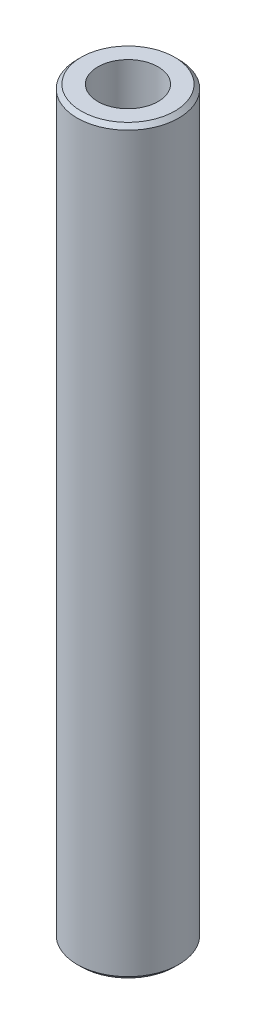
ISO-10303-21;
HEADER;
FILE_DESCRIPTION(('STEP AP214'),'2;1');
FILE_NAME('part.step','',(''),(''),'','','');
FILE_SCHEMA(('AUTOMOTIVE_DESIGN { 1 0 10303 214 1 1 1 1 }'));
ENDSEC;
DATA;
#1=APPLICATION_CONTEXT('core data for automotive mechanical design processes');
#2=APPLICATION_PROTOCOL_DEFINITION('international standard','automotive_design',2000,#1);
#3=PRODUCT_CONTEXT('',#1,'mechanical');
#4=PRODUCT('Part','Part','',(#3));
#5=PRODUCT_RELATED_PRODUCT_CATEGORY('part','',(#4));
#6=PRODUCT_DEFINITION_FORMATION('','',#4);
#7=PRODUCT_DEFINITION_CONTEXT('part definition',#1,'design');
#8=PRODUCT_DEFINITION('design','',#6,#7);
#9=PRODUCT_DEFINITION_SHAPE('','',#8);
#10=(LENGTH_UNIT() NAMED_UNIT(*) SI_UNIT(.MILLI.,.METRE.));
#11=(NAMED_UNIT(*) PLANE_ANGLE_UNIT() SI_UNIT($,.RADIAN.));
#12=(NAMED_UNIT(*) SI_UNIT($,.STERADIAN.) SOLID_ANGLE_UNIT());
#13=UNCERTAINTY_MEASURE_WITH_UNIT(LENGTH_MEASURE(1.E-05),#10,'distance_accuracy_value','');
#14=(GEOMETRIC_REPRESENTATION_CONTEXT(3) GLOBAL_UNCERTAINTY_ASSIGNED_CONTEXT((#13)) GLOBAL_UNIT_ASSIGNED_CONTEXT((#10,
#11,#12)) REPRESENTATION_CONTEXT('',''));
#15=CARTESIAN_POINT('',(0.,0.,0.));
#16=DIRECTION('',(0.,0.,1.));
#17=DIRECTION('',(1.,0.,0.));
#18=AXIS2_PLACEMENT_3D('',#15,#16,#17);
#19=CARTESIAN_POINT('',(0.,547.492536187515,0.));
#20=DIRECTION('',(0.,-1.,0.));
#21=DIRECTION('',(0.,0.,-1.));
#22=AXIS2_PLACEMENT_3D('',#19,#20,#21);
#23=CYLINDRICAL_SURFACE('',#22,37.5);
#24=CARTESIAN_POINT('',(0.,544.538281992372,0.));
#25=DIRECTION('',(0.,1.,0.));
#26=DIRECTION('',(0.,0.,1.));
#27=AXIS2_PLACEMENT_3D('',#24,#25,#26);
#28=CIRCLE('',#27,37.5);
#29=CARTESIAN_POINT('',(0.,544.538281992372,37.5));
#30=VERTEX_POINT('',#29);
#31=EDGE_CURVE('E50',#30,#30,#28,.F.);
#32=ORIENTED_EDGE('',*,*,#31,.T.);
#33=EDGE_LOOP('',(#32));
#34=FACE_BOUND('',#33,.T.);
#35=CARTESIAN_POINT('',(0.,2.95425419514317,0.));
#36=DIRECTION('',(0.,1.,0.));
#37=DIRECTION('',(0.,0.,1.));
#38=AXIS2_PLACEMENT_3D('',#35,#36,#37);
#39=CIRCLE('',#38,37.5);
#40=CARTESIAN_POINT('',(0.,2.95425419514317,37.5));
#41=VERTEX_POINT('',#40);
#42=EDGE_CURVE('E51',#41,#41,#39,.T.);
#43=ORIENTED_EDGE('',*,*,#42,.T.);
#44=EDGE_LOOP('',(#43));
#45=FACE_BOUND('',#44,.T.);
#46=ADVANCED_FACE('F39',(#34,#45),#23,.T.);
#47=CARTESIAN_POINT('',(0.,547.492536187515,0.));
#48=DIRECTION('',(0.,1.,0.));
#49=DIRECTION('',(0.,0.,1.));
#50=AXIS2_PLACEMENT_3D('',#47,#48,#49);
#51=PLANE('',#50);
#52=CARTESIAN_POINT('',(0.,547.492536187515,0.));
#53=DIRECTION('',(0.,1.,0.));
#54=DIRECTION('',(0.,0.,1.));
#55=AXIS2_PLACEMENT_3D('',#52,#53,#54);
#56=CIRCLE('',#55,34.5457458048566);
#57=CARTESIAN_POINT('',(0.,547.492536187515,34.5457458048566));
#58=VERTEX_POINT('',#57);
#59=EDGE_CURVE('E54',#58,#58,#56,.T.);
#60=ORIENTED_EDGE('',*,*,#59,.T.);
#61=EDGE_LOOP('',(#60));
#62=FACE_BOUND('',#61,.T.);
#63=CARTESIAN_POINT('',(0.,547.492536187515,0.));
#64=DIRECTION('',(0.,1.,0.));
#65=DIRECTION('',(0.,0.,1.));
#66=AXIS2_PLACEMENT_3D('',#63,#64,#65);
#67=CIRCLE('',#66,22.2610301837243);
#68=CARTESIAN_POINT('',(0.,547.492536187515,22.2610301837243));
#69=VERTEX_POINT('',#68);
#70=EDGE_CURVE('E58',#69,#69,#67,.T.);
#71=ORIENTED_EDGE('',*,*,#70,.F.);
#72=EDGE_LOOP('',(#71));
#73=FACE_BOUND('',#72,.T.);
#74=ADVANCED_FACE('F69',(#62,#73),#51,.T.);
#75=CARTESIAN_POINT('',(0.,0.,0.));
#76=DIRECTION('',(0.,1.,0.));
#77=DIRECTION('',(0.,0.,1.));
#78=AXIS2_PLACEMENT_3D('',#75,#76,#77);
#79=PLANE('',#78);
#80=CARTESIAN_POINT('',(0.,0.,0.));
#81=DIRECTION('',(0.,1.,0.));
#82=DIRECTION('',(0.,0.,1.));
#83=AXIS2_PLACEMENT_3D('',#80,#81,#82);
#84=CIRCLE('',#83,34.5457458048568);
#85=CARTESIAN_POINT('',(0.,0.,34.5457458048568));
#86=VERTEX_POINT('',#85);
#87=EDGE_CURVE('E10',#86,#86,#84,.F.);
#88=ORIENTED_EDGE('',*,*,#87,.T.);
#89=EDGE_LOOP('',(#88));
#90=FACE_BOUND('',#89,.T.);
#91=CARTESIAN_POINT('',(0.,0.,0.));
#92=DIRECTION('',(0.,1.,0.));
#93=DIRECTION('',(0.,0.,1.));
#94=AXIS2_PLACEMENT_3D('',#91,#92,#93);
#95=CIRCLE('',#94,22.2610301837243);
#96=CARTESIAN_POINT('',(0.,0.,22.2610301837243));
#97=VERTEX_POINT('',#96);
#98=EDGE_CURVE('E63',#97,#97,#95,.T.);
#99=ORIENTED_EDGE('',*,*,#98,.T.);
#100=EDGE_LOOP('',(#99));
#101=FACE_BOUND('',#100,.T.);
#102=ADVANCED_FACE('F75',(#90,#101),#79,.F.);
#103=CARTESIAN_POINT('',(0.,547.492536187515,0.));
#104=DIRECTION('',(0.,-1.,0.));
#105=DIRECTION('',(0.,0.,-1.));
#106=AXIS2_PLACEMENT_3D('',#103,#104,#105);
#107=CYLINDRICAL_SURFACE('',#106,22.2610301837243);
#108=ORIENTED_EDGE('',*,*,#70,.T.);
#109=EDGE_LOOP('',(#108));
#110=FACE_BOUND('',#109,.T.);
#111=ORIENTED_EDGE('',*,*,#98,.F.);
#112=EDGE_LOOP('',(#111));
#113=FACE_BOUND('',#112,.T.);
#114=ADVANCED_FACE('F70',(#110,#113),#107,.F.);
#115=CARTESIAN_POINT('',(0.,547.492536187515,0.));
#116=DIRECTION('',(0.,-1.,0.));
#117=DIRECTION('',(0.,0.,-1.));
#118=AXIS2_PLACEMENT_3D('',#115,#116,#117);
#119=CONICAL_SURFACE('',#118,34.5457458048566,0.785398163397444);
#120=ORIENTED_EDGE('',*,*,#31,.F.);
#121=EDGE_LOOP('',(#120));
#122=FACE_BOUND('',#121,.T.);
#123=ORIENTED_EDGE('',*,*,#59,.F.);
#124=EDGE_LOOP('',(#123));
#125=FACE_BOUND('',#124,.T.);
#126=ADVANCED_FACE('F81',(#122,#125),#119,.T.);
#127=CARTESIAN_POINT('',(0.,2.95425419514317,0.));
#128=DIRECTION('',(0.,1.,0.));
#129=DIRECTION('',(0.,0.,1.));
#130=AXIS2_PLACEMENT_3D('',#127,#128,#129);
#131=CONICAL_SURFACE('',#130,37.5,0.785398163397462);
#132=ORIENTED_EDGE('',*,*,#87,.F.);
#133=EDGE_LOOP('',(#132));
#134=FACE_BOUND('',#133,.T.);
#135=ORIENTED_EDGE('',*,*,#42,.F.);
#136=EDGE_LOOP('',(#135));
#137=FACE_BOUND('',#136,.T.);
#138=ADVANCED_FACE('F45',(#134,#137),#131,.T.);
#139=CLOSED_SHELL('',(#46,#74,#102,#114,#126,#138));
#140=MANIFOLD_SOLID_BREP('B2',#139);
#141=ADVANCED_BREP_SHAPE_REPRESENTATION('',(#18,#140),#14);
#142=SHAPE_DEFINITION_REPRESENTATION(#9,#141);
ENDSEC;
END-ISO-10303-21;
